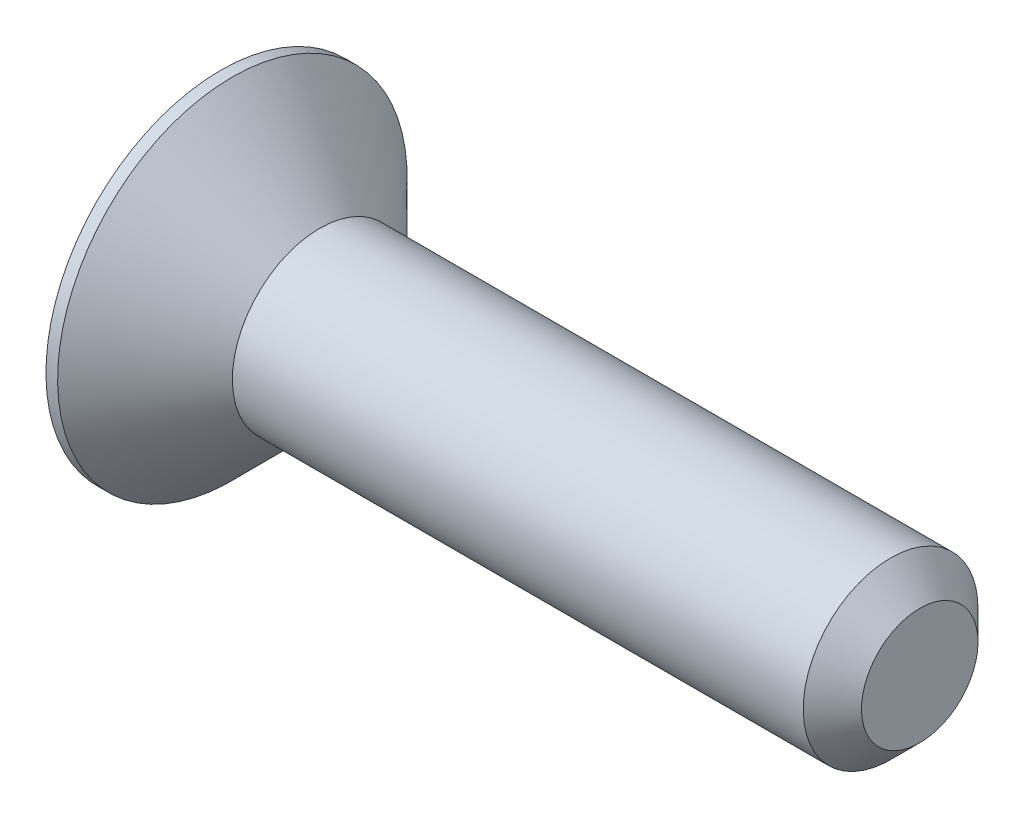
ISO-10303-21;
HEADER;
FILE_DESCRIPTION(('STEP AP214'),'2;1');
FILE_NAME('part.step','',(''),(''),'','','');
FILE_SCHEMA(('AUTOMOTIVE_DESIGN { 1 0 10303 214 1 1 1 1 }'));
ENDSEC;
DATA;
#1=APPLICATION_CONTEXT('core data for automotive mechanical design processes');
#2=APPLICATION_PROTOCOL_DEFINITION('international standard','automotive_design',2000,#1);
#3=PRODUCT_CONTEXT('',#1,'mechanical');
#4=PRODUCT('Part','Part','',(#3));
#5=PRODUCT_RELATED_PRODUCT_CATEGORY('part','',(#4));
#6=PRODUCT_DEFINITION_FORMATION('','',#4);
#7=PRODUCT_DEFINITION_CONTEXT('part definition',#1,'design');
#8=PRODUCT_DEFINITION('design','',#6,#7);
#9=PRODUCT_DEFINITION_SHAPE('','',#8);
#10=(LENGTH_UNIT() NAMED_UNIT(*) SI_UNIT(.MILLI.,.METRE.));
#11=(NAMED_UNIT(*) PLANE_ANGLE_UNIT() SI_UNIT($,.RADIAN.));
#12=(NAMED_UNIT(*) SI_UNIT($,.STERADIAN.) SOLID_ANGLE_UNIT());
#13=UNCERTAINTY_MEASURE_WITH_UNIT(LENGTH_MEASURE(1.E-05),#10,'distance_accuracy_value','');
#14=(GEOMETRIC_REPRESENTATION_CONTEXT(3) GLOBAL_UNCERTAINTY_ASSIGNED_CONTEXT((#13)) GLOBAL_UNIT_ASSIGNED_CONTEXT((#10,
#11,#12)) REPRESENTATION_CONTEXT('',''));
#15=CARTESIAN_POINT('',(0.,0.,0.));
#16=DIRECTION('',(0.,0.,1.));
#17=DIRECTION('',(1.,0.,0.));
#18=AXIS2_PLACEMENT_3D('',#15,#16,#17);
#19=CARTESIAN_POINT('',(0.,0.,0.));
#20=DIRECTION('',(-1.,0.,0.));
#21=DIRECTION('',(0.,-1.,0.));
#22=AXIS2_PLACEMENT_3D('',#19,#20,#21);
#23=PLANE('',#22);
#24=DIRECTION('',(0.,0.5,-0.866025403784438));
#25=VECTOR('',#24,1.);
#26=CARTESIAN_POINT('',(0.,0.577350269189626,1.));
#27=LINE('',#26,#25);
#28=CARTESIAN_POINT('',(0.,0.577350269189626,1.));
#29=VERTEX_POINT('',#28);
#30=CARTESIAN_POINT('',(0.,1.15470053837925,0.));
#31=VERTEX_POINT('',#30);
#32=EDGE_CURVE('E48',#29,#31,#27,.T.);
#33=ORIENTED_EDGE('',*,*,#32,.F.);
#34=DIRECTION('',(0.,1.,0.));
#35=VECTOR('',#34,1.);
#36=CARTESIAN_POINT('',(0.,-0.577350269189626,1.));
#37=LINE('',#36,#35);
#38=CARTESIAN_POINT('',(0.,-0.577350269189626,1.));
#39=VERTEX_POINT('',#38);
#40=EDGE_CURVE('E131',#39,#29,#37,.T.);
#41=ORIENTED_EDGE('',*,*,#40,.F.);
#42=DIRECTION('',(0.,0.5,0.866025403784439));
#43=VECTOR('',#42,1.);
#44=CARTESIAN_POINT('',(0.,-1.15470053837925,0.));
#45=LINE('',#44,#43);
#46=CARTESIAN_POINT('',(0.,-1.15470053837925,0.));
#47=VERTEX_POINT('',#46);
#48=EDGE_CURVE('E129',#47,#39,#45,.T.);
#49=ORIENTED_EDGE('',*,*,#48,.F.);
#50=DIRECTION('',(0.,-0.5,0.866025403784439));
#51=VECTOR('',#50,1.);
#52=CARTESIAN_POINT('',(0.,-0.577350269189625,-1.));
#53=LINE('',#52,#51);
#54=CARTESIAN_POINT('',(0.,-0.577350269189625,-1.));
#55=VERTEX_POINT('',#54);
#56=EDGE_CURVE('E96',#55,#47,#53,.T.);
#57=ORIENTED_EDGE('',*,*,#56,.F.);
#58=DIRECTION('',(0.,-1.,0.));
#59=VECTOR('',#58,1.);
#60=CARTESIAN_POINT('',(0.,0.577350269189626,-1.));
#61=LINE('',#60,#59);
#62=CARTESIAN_POINT('',(0.,0.577350269189626,-1.));
#63=VERTEX_POINT('',#62);
#64=EDGE_CURVE('E125',#63,#55,#61,.T.);
#65=ORIENTED_EDGE('',*,*,#64,.F.);
#66=DIRECTION('',(0.,-0.5,-0.866025403784439));
#67=VECTOR('',#66,1.);
#68=CARTESIAN_POINT('',(0.,1.15470053837925,0.));
#69=LINE('',#68,#67);
#70=EDGE_CURVE('E122',#31,#63,#69,.T.);
#71=ORIENTED_EDGE('',*,*,#70,.F.);
#72=EDGE_LOOP('',(#33,#41,#49,#57,#65,#71));
#73=FACE_BOUND('',#72,.T.);
#74=CARTESIAN_POINT('',(0.,0.,0.));
#75=DIRECTION('',(1.,0.,0.));
#76=DIRECTION('',(0.,1.,0.));
#77=AXIS2_PLACEMENT_3D('',#74,#75,#76);
#78=CIRCLE('',#77,3.);
#79=CARTESIAN_POINT('',(0.,3.,0.));
#80=VERTEX_POINT('',#79);
#81=EDGE_CURVE('E146',#80,#80,#78,.T.);
#82=ORIENTED_EDGE('',*,*,#81,.F.);
#83=EDGE_LOOP('',(#82));
#84=FACE_BOUND('',#83,.T.);
#85=ADVANCED_FACE('F33',(#73,#84),#23,.T.);
#86=CARTESIAN_POINT('',(12.,0.,0.));
#87=DIRECTION('',(1.,0.,0.));
#88=DIRECTION('',(0.,1.,0.));
#89=AXIS2_PLACEMENT_3D('',#86,#87,#88);
#90=CYLINDRICAL_SURFACE('',#89,3.);
#91=ORIENTED_EDGE('',*,*,#81,.T.);
#92=EDGE_LOOP('',(#91));
#93=FACE_BOUND('',#92,.T.);
#94=CARTESIAN_POINT('',(0.199999999999964,0.,0.));
#95=DIRECTION('',(1.,0.,0.));
#96=DIRECTION('',(0.,1.,0.));
#97=AXIS2_PLACEMENT_3D('',#94,#95,#96);
#98=CIRCLE('',#97,3.);
#99=CARTESIAN_POINT('',(0.199999999999964,3.,0.));
#100=VERTEX_POINT('',#99);
#101=EDGE_CURVE('E143',#100,#100,#98,.T.);
#102=ORIENTED_EDGE('',*,*,#101,.F.);
#103=EDGE_LOOP('',(#102));
#104=FACE_BOUND('',#103,.T.);
#105=ADVANCED_FACE('F166',(#93,#104),#90,.T.);
#106=CARTESIAN_POINT('',(1.7,0.,0.));
#107=DIRECTION('',(-1.,0.,0.));
#108=DIRECTION('',(0.,-1.,0.));
#109=AXIS2_PLACEMENT_3D('',#106,#107,#108);
#110=CONICAL_SURFACE('',#109,1.5,0.785398163397437);
#111=ORIENTED_EDGE('',*,*,#101,.T.);
#112=EDGE_LOOP('',(#111));
#113=FACE_BOUND('',#112,.T.);
#114=CARTESIAN_POINT('',(1.7,0.,0.));
#115=DIRECTION('',(1.,0.,0.));
#116=DIRECTION('',(0.,1.,0.));
#117=AXIS2_PLACEMENT_3D('',#114,#115,#116);
#118=CIRCLE('',#117,1.5);
#119=CARTESIAN_POINT('',(1.7,1.5,0.));
#120=VERTEX_POINT('',#119);
#121=EDGE_CURVE('E135',#120,#120,#118,.T.);
#122=ORIENTED_EDGE('',*,*,#121,.F.);
#123=EDGE_LOOP('',(#122));
#124=FACE_BOUND('',#123,.T.);
#125=ADVANCED_FACE('F171',(#113,#124),#110,.T.);
#126=CARTESIAN_POINT('',(12.,0.,0.));
#127=DIRECTION('',(1.,0.,0.));
#128=DIRECTION('',(0.,1.,0.));
#129=AXIS2_PLACEMENT_3D('',#126,#127,#128);
#130=CYLINDRICAL_SURFACE('',#129,1.5);
#131=CARTESIAN_POINT('',(11.5,0.,0.));
#132=DIRECTION('',(1.,0.,0.));
#133=DIRECTION('',(0.,1.,0.));
#134=AXIS2_PLACEMENT_3D('',#131,#132,#133);
#135=CIRCLE('',#134,1.5);
#136=CARTESIAN_POINT('',(11.5,1.5,0.));
#137=VERTEX_POINT('',#136);
#138=EDGE_CURVE('E11',#137,#137,#135,.F.);
#139=ORIENTED_EDGE('',*,*,#138,.T.);
#140=EDGE_LOOP('',(#139));
#141=FACE_BOUND('',#140,.T.);
#142=ORIENTED_EDGE('',*,*,#121,.T.);
#143=EDGE_LOOP('',(#142));
#144=FACE_BOUND('',#143,.T.);
#145=ADVANCED_FACE('F162',(#141,#144),#130,.T.);
#146=CARTESIAN_POINT('',(12.,1.5,0.));
#147=DIRECTION('',(1.,0.,0.));
#148=DIRECTION('',(0.,1.,0.));
#149=AXIS2_PLACEMENT_3D('',#146,#147,#148);
#150=PLANE('',#149);
#151=CARTESIAN_POINT('',(12.,0.,0.));
#152=DIRECTION('',(1.,0.,0.));
#153=DIRECTION('',(0.,1.,0.));
#154=AXIS2_PLACEMENT_3D('',#151,#152,#153);
#155=CIRCLE('',#154,0.999999999999997);
#156=CARTESIAN_POINT('',(12.,0.999999999999999,0.));
#157=VERTEX_POINT('',#156);
#158=EDGE_CURVE('E41',#157,#157,#155,.T.);
#159=ORIENTED_EDGE('',*,*,#158,.T.);
#160=EDGE_LOOP('',(#159));
#161=FACE_BOUND('',#160,.T.);
#162=ADVANCED_FACE('F151',(#161),#150,.T.);
#163=CARTESIAN_POINT('',(12.,0.,0.));
#164=DIRECTION('',(-1.,0.,0.));
#165=DIRECTION('',(0.,-1.,0.));
#166=AXIS2_PLACEMENT_3D('',#163,#164,#165);
#167=CONICAL_SURFACE('',#166,0.999999999999997,0.785398163397448);
#168=ORIENTED_EDGE('',*,*,#138,.F.);
#169=EDGE_LOOP('',(#168));
#170=FACE_BOUND('',#169,.T.);
#171=ORIENTED_EDGE('',*,*,#158,.F.);
#172=EDGE_LOOP('',(#171));
#173=FACE_BOUND('',#172,.T.);
#174=ADVANCED_FACE('F35',(#170,#173),#167,.T.);
#175=CARTESIAN_POINT('',(1.2,0.577350269189626,1.));
#176=DIRECTION('',(0.,0.866025403784439,0.5));
#177=DIRECTION('',(0.,-0.5,0.866025403784439));
#178=AXIS2_PLACEMENT_3D('',#175,#176,#177);
#179=PLANE('',#178);
#180=ORIENTED_EDGE('',*,*,#32,.T.);
#181=DIRECTION('',(-1.,0.,0.));
#182=VECTOR('',#181,1.);
#183=CARTESIAN_POINT('',(1.2,1.15470053837925,0.));
#184=LINE('',#183,#182);
#185=CARTESIAN_POINT('',(1.2,1.15470053837925,0.));
#186=VERTEX_POINT('',#185);
#187=EDGE_CURVE('E78',#186,#31,#184,.T.);
#188=ORIENTED_EDGE('',*,*,#187,.F.);
#189=DIRECTION('',(0.,0.5,-0.866025403784438));
#190=VECTOR('',#189,1.);
#191=CARTESIAN_POINT('',(1.2,0.577350269189626,1.));
#192=LINE('',#191,#190);
#193=CARTESIAN_POINT('',(1.2,0.577350269189626,1.));
#194=VERTEX_POINT('',#193);
#195=EDGE_CURVE('E133',#194,#186,#192,.T.);
#196=ORIENTED_EDGE('',*,*,#195,.F.);
#197=DIRECTION('',(-1.,0.,0.));
#198=VECTOR('',#197,1.);
#199=CARTESIAN_POINT('',(1.2,0.577350269189626,1.));
#200=LINE('',#199,#198);
#201=EDGE_CURVE('E56',#194,#29,#200,.T.);
#202=ORIENTED_EDGE('',*,*,#201,.T.);
#203=EDGE_LOOP('',(#180,#188,#196,#202));
#204=FACE_BOUND('',#203,.T.);
#205=ADVANCED_FACE('F154',(#204),#179,.F.);
#206=CARTESIAN_POINT('',(1.2,-0.577350269189627,1.));
#207=DIRECTION('',(0.,0.,1.));
#208=DIRECTION('',(0.,-1.,0.));
#209=AXIS2_PLACEMENT_3D('',#206,#207,#208);
#210=PLANE('',#209);
#211=ORIENTED_EDGE('',*,*,#40,.T.);
#212=ORIENTED_EDGE('',*,*,#201,.F.);
#213=DIRECTION('',(0.,1.,0.));
#214=VECTOR('',#213,1.);
#215=CARTESIAN_POINT('',(1.2,-0.577350269189627,1.));
#216=LINE('',#215,#214);
#217=CARTESIAN_POINT('',(1.2,-0.577350269189627,1.));
#218=VERTEX_POINT('',#217);
#219=EDGE_CURVE('E108',#218,#194,#216,.T.);
#220=ORIENTED_EDGE('',*,*,#219,.F.);
#221=DIRECTION('',(-1.,0.,0.));
#222=VECTOR('',#221,1.);
#223=CARTESIAN_POINT('',(1.2,-0.577350269189627,1.));
#224=LINE('',#223,#222);
#225=EDGE_CURVE('E100',#218,#39,#224,.T.);
#226=ORIENTED_EDGE('',*,*,#225,.T.);
#227=EDGE_LOOP('',(#211,#212,#220,#226));
#228=FACE_BOUND('',#227,.T.);
#229=ADVANCED_FACE('F160',(#228),#210,.F.);
#230=CARTESIAN_POINT('',(1.2,-1.15470053837925,0.));
#231=DIRECTION('',(0.,-0.866025403784439,0.5));
#232=DIRECTION('',(0.,-0.5,-0.866025403784439));
#233=AXIS2_PLACEMENT_3D('',#230,#231,#232);
#234=PLANE('',#233);
#235=ORIENTED_EDGE('',*,*,#48,.T.);
#236=ORIENTED_EDGE('',*,*,#225,.F.);
#237=DIRECTION('',(0.,0.5,0.866025403784439));
#238=VECTOR('',#237,1.);
#239=CARTESIAN_POINT('',(1.2,-1.15470053837925,0.));
#240=LINE('',#239,#238);
#241=CARTESIAN_POINT('',(1.2,-1.15470053837925,0.));
#242=VERTEX_POINT('',#241);
#243=EDGE_CURVE('E104',#242,#218,#240,.T.);
#244=ORIENTED_EDGE('',*,*,#243,.F.);
#245=DIRECTION('',(-1.,0.,0.));
#246=VECTOR('',#245,1.);
#247=CARTESIAN_POINT('',(1.2,-1.15470053837925,0.));
#248=LINE('',#247,#246);
#249=EDGE_CURVE('E89',#242,#47,#248,.T.);
#250=ORIENTED_EDGE('',*,*,#249,.T.);
#251=EDGE_LOOP('',(#235,#236,#244,#250));
#252=FACE_BOUND('',#251,.T.);
#253=ADVANCED_FACE('F105',(#252),#234,.F.);
#254=CARTESIAN_POINT('',(1.2,-0.577350269189626,-1.));
#255=DIRECTION('',(0.,-0.866025403784439,-0.5));
#256=DIRECTION('',(0.,0.5,-0.866025403784439));
#257=AXIS2_PLACEMENT_3D('',#254,#255,#256);
#258=PLANE('',#257);
#259=ORIENTED_EDGE('',*,*,#56,.T.);
#260=ORIENTED_EDGE('',*,*,#249,.F.);
#261=DIRECTION('',(0.,-0.5,0.866025403784439));
#262=VECTOR('',#261,1.);
#263=CARTESIAN_POINT('',(1.2,-0.577350269189626,-1.));
#264=LINE('',#263,#262);
#265=CARTESIAN_POINT('',(1.2,-0.577350269189626,-1.));
#266=VERTEX_POINT('',#265);
#267=EDGE_CURVE('E93',#266,#242,#264,.T.);
#268=ORIENTED_EDGE('',*,*,#267,.F.);
#269=DIRECTION('',(-1.,0.,0.));
#270=VECTOR('',#269,1.);
#271=CARTESIAN_POINT('',(1.2,-0.577350269189626,-1.));
#272=LINE('',#271,#270);
#273=EDGE_CURVE('E101',#266,#55,#272,.T.);
#274=ORIENTED_EDGE('',*,*,#273,.T.);
#275=EDGE_LOOP('',(#259,#260,#268,#274));
#276=FACE_BOUND('',#275,.T.);
#277=ADVANCED_FACE('F91',(#276),#258,.F.);
#278=CARTESIAN_POINT('',(1.2,0.577350269189626,-1.));
#279=DIRECTION('',(0.,0.,-1.));
#280=DIRECTION('',(-1.,0.,0.));
#281=AXIS2_PLACEMENT_3D('',#278,#279,#280);
#282=PLANE('',#281);
#283=ORIENTED_EDGE('',*,*,#64,.T.);
#284=ORIENTED_EDGE('',*,*,#273,.F.);
#285=DIRECTION('',(0.,-1.,0.));
#286=VECTOR('',#285,1.);
#287=CARTESIAN_POINT('',(1.2,0.577350269189626,-1.));
#288=LINE('',#287,#286);
#289=CARTESIAN_POINT('',(1.2,0.577350269189626,-1.));
#290=VERTEX_POINT('',#289);
#291=EDGE_CURVE('E114',#290,#266,#288,.T.);
#292=ORIENTED_EDGE('',*,*,#291,.F.);
#293=DIRECTION('',(-1.,0.,0.));
#294=VECTOR('',#293,1.);
#295=CARTESIAN_POINT('',(1.2,0.577350269189626,-1.));
#296=LINE('',#295,#294);
#297=EDGE_CURVE('E138',#290,#63,#296,.T.);
#298=ORIENTED_EDGE('',*,*,#297,.T.);
#299=EDGE_LOOP('',(#283,#284,#292,#298));
#300=FACE_BOUND('',#299,.T.);
#301=ADVANCED_FACE('F185',(#300),#282,.F.);
#302=CARTESIAN_POINT('',(1.2,1.15470053837925,0.));
#303=DIRECTION('',(0.,0.866025403784439,-0.5));
#304=DIRECTION('',(0.,0.5,0.866025403784439));
#305=AXIS2_PLACEMENT_3D('',#302,#303,#304);
#306=PLANE('',#305);
#307=ORIENTED_EDGE('',*,*,#70,.T.);
#308=ORIENTED_EDGE('',*,*,#297,.F.);
#309=DIRECTION('',(0.,-0.5,-0.866025403784439));
#310=VECTOR('',#309,1.);
#311=CARTESIAN_POINT('',(1.2,1.15470053837925,0.));
#312=LINE('',#311,#310);
#313=EDGE_CURVE('E116',#186,#290,#312,.T.);
#314=ORIENTED_EDGE('',*,*,#313,.F.);
#315=ORIENTED_EDGE('',*,*,#187,.T.);
#316=EDGE_LOOP('',(#307,#308,#314,#315));
#317=FACE_BOUND('',#316,.T.);
#318=ADVANCED_FACE('F182',(#317),#306,.F.);
#319=CARTESIAN_POINT('',(1.2,0.,0.));
#320=DIRECTION('',(-1.,0.,0.));
#321=DIRECTION('',(0.,-1.,0.));
#322=AXIS2_PLACEMENT_3D('',#319,#320,#321);
#323=PLANE('',#322);
#324=ORIENTED_EDGE('',*,*,#195,.T.);
#325=ORIENTED_EDGE('',*,*,#313,.T.);
#326=ORIENTED_EDGE('',*,*,#291,.T.);
#327=ORIENTED_EDGE('',*,*,#267,.T.);
#328=ORIENTED_EDGE('',*,*,#243,.T.);
#329=ORIENTED_EDGE('',*,*,#219,.T.);
#330=EDGE_LOOP('',(#324,#325,#326,#327,#328,#329));
#331=FACE_BOUND('',#330,.T.);
#332=ADVANCED_FACE('F111',(#331),#323,.T.);
#333=CLOSED_SHELL('',(#85,#105,#125,#145,#162,#174,#205,#229,#253,#277,#301,#318,#332));
#334=MANIFOLD_SOLID_BREP('B2',#333);
#335=ADVANCED_BREP_SHAPE_REPRESENTATION('',(#18,#334),#14);
#336=SHAPE_DEFINITION_REPRESENTATION(#9,#335);
ENDSEC;
END-ISO-10303-21;
